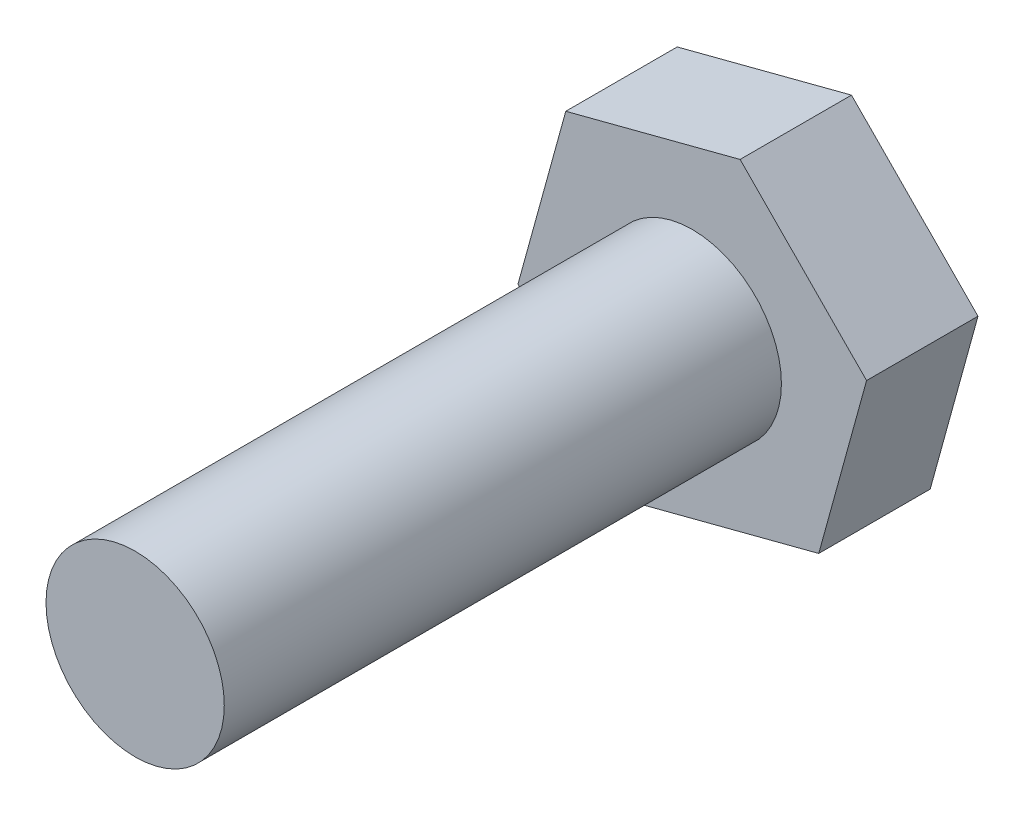
ISO-10303-21;
HEADER;
FILE_DESCRIPTION(('STEP AP214'),'2;1');
FILE_NAME('part.step','',(''),(''),'','','');
FILE_SCHEMA(('AUTOMOTIVE_DESIGN { 1 0 10303 214 1 1 1 1 }'));
ENDSEC;
DATA;
#1=APPLICATION_CONTEXT('core data for automotive mechanical design processes');
#2=APPLICATION_PROTOCOL_DEFINITION('international standard','automotive_design',2000,#1);
#3=PRODUCT_CONTEXT('',#1,'mechanical');
#4=PRODUCT('Part','Part','',(#3));
#5=PRODUCT_RELATED_PRODUCT_CATEGORY('part','',(#4));
#6=PRODUCT_DEFINITION_FORMATION('','',#4);
#7=PRODUCT_DEFINITION_CONTEXT('part definition',#1,'design');
#8=PRODUCT_DEFINITION('design','',#6,#7);
#9=PRODUCT_DEFINITION_SHAPE('','',#8);
#10=(LENGTH_UNIT() NAMED_UNIT(*) SI_UNIT(.MILLI.,.METRE.));
#11=(NAMED_UNIT(*) PLANE_ANGLE_UNIT() SI_UNIT($,.RADIAN.));
#12=(NAMED_UNIT(*) SI_UNIT($,.STERADIAN.) SOLID_ANGLE_UNIT());
#13=UNCERTAINTY_MEASURE_WITH_UNIT(LENGTH_MEASURE(1.E-05),#10,'distance_accuracy_value','');
#14=(GEOMETRIC_REPRESENTATION_CONTEXT(3) GLOBAL_UNCERTAINTY_ASSIGNED_CONTEXT((#13)) GLOBAL_UNIT_ASSIGNED_CONTEXT((#10,
#11,#12)) REPRESENTATION_CONTEXT('',''));
#15=CARTESIAN_POINT('',(0.,0.,0.));
#16=DIRECTION('',(0.,0.,1.));
#17=DIRECTION('',(1.,0.,0.));
#18=AXIS2_PLACEMENT_3D('',#15,#16,#17);
#19=CARTESIAN_POINT('',(-2.14543503921936,-7.79297387560251,5.));
#20=DIRECTION('',(-0.252197199176515,0.967675861395499,0.));
#21=DIRECTION('',(-0.967675861395499,-0.252197199176515,0.));
#22=AXIS2_PLACEMENT_3D('',#19,#20,#21);
#23=PLANE('',#22);
#24=DIRECTION('',(0.967675861395499,0.252197199176515,0.));
#25=VECTOR('',#24,1.);
#26=CARTESIAN_POINT('',(-2.14543503921936,-7.79297387560251,0.));
#27=LINE('',#26,#25);
#28=CARTESIAN_POINT('',(-2.14543503921936,-7.79297387560251,0.));
#29=VERTEX_POINT('',#28);
#30=CARTESIAN_POINT('',(5.67619582769056,-5.75448818393448,0.));
#31=VERTEX_POINT('',#30);
#32=EDGE_CURVE('E117',#29,#31,#27,.T.);
#33=ORIENTED_EDGE('',*,*,#32,.T.);
#34=DIRECTION('',(0.,0.,-1.));
#35=VECTOR('',#34,1.);
#36=CARTESIAN_POINT('',(5.67619582769056,-5.75448818393448,5.));
#37=LINE('',#36,#35);
#38=CARTESIAN_POINT('',(5.67619582769056,-5.75448818393448,5.));
#39=VERTEX_POINT('',#38);
#40=EDGE_CURVE('E11',#39,#31,#37,.T.);
#41=ORIENTED_EDGE('',*,*,#40,.F.);
#42=DIRECTION('',(0.967675861395499,0.252197199176515,0.));
#43=VECTOR('',#42,1.);
#44=CARTESIAN_POINT('',(-2.14543503921936,-7.79297387560251,5.));
#45=LINE('',#44,#43);
#46=CARTESIAN_POINT('',(-2.14543503921936,-7.79297387560251,5.));
#47=VERTEX_POINT('',#46);
#48=EDGE_CURVE('E128',#47,#39,#45,.T.);
#49=ORIENTED_EDGE('',*,*,#48,.F.);
#50=DIRECTION('',(0.,0.,-1.));
#51=VECTOR('',#50,1.);
#52=CARTESIAN_POINT('',(-2.14543503921936,-7.79297387560251,5.));
#53=LINE('',#52,#51);
#54=EDGE_CURVE('E113',#47,#29,#53,.T.);
#55=ORIENTED_EDGE('',*,*,#54,.T.);
#56=EDGE_LOOP('',(#33,#41,#49,#55));
#57=FACE_BOUND('',#56,.T.);
#58=ADVANCED_FACE('F33',(#57),#23,.F.);
#59=CARTESIAN_POINT('',(5.67619582769056,-5.75448818393448,5.));
#60=DIRECTION('',(-0.964130478185749,0.265428749447604,0.));
#61=DIRECTION('',(-0.265428749447604,-0.964130478185749,0.));
#62=AXIS2_PLACEMENT_3D('',#59,#60,#61);
#63=PLANE('',#62);
#64=DIRECTION('',(0.265428749447604,0.964130478185749,0.));
#65=VECTOR('',#64,1.);
#66=CARTESIAN_POINT('',(5.67619582769056,-5.75448818393448,0.));
#67=LINE('',#66,#65);
#68=CARTESIAN_POINT('',(7.82163086690992,2.03848569166803,0.));
#69=VERTEX_POINT('',#68);
#70=EDGE_CURVE('E120',#31,#69,#67,.T.);
#71=ORIENTED_EDGE('',*,*,#70,.T.);
#72=DIRECTION('',(0.,0.,-1.));
#73=VECTOR('',#72,1.);
#74=CARTESIAN_POINT('',(7.82163086690992,2.03848569166803,5.));
#75=LINE('',#74,#73);
#76=CARTESIAN_POINT('',(7.82163086690992,2.03848569166803,5.));
#77=VERTEX_POINT('',#76);
#78=EDGE_CURVE('E41',#77,#69,#75,.T.);
#79=ORIENTED_EDGE('',*,*,#78,.F.);
#80=DIRECTION('',(0.265428749447604,0.964130478185749,0.));
#81=VECTOR('',#80,1.);
#82=CARTESIAN_POINT('',(5.67619582769056,-5.75448818393448,5.));
#83=LINE('',#82,#81);
#84=EDGE_CURVE('E86',#39,#77,#83,.T.);
#85=ORIENTED_EDGE('',*,*,#84,.F.);
#86=ORIENTED_EDGE('',*,*,#40,.T.);
#87=EDGE_LOOP('',(#71,#79,#85,#86));
#88=FACE_BOUND('',#87,.T.);
#89=ADVANCED_FACE('F153',(#88),#63,.F.);
#90=CARTESIAN_POINT('',(7.82163086690992,2.03848569166803,5.));
#91=DIRECTION('',(-0.711933279009234,-0.702247111947895,0.));
#92=DIRECTION('',(0.702247111947895,-0.711933279009234,0.));
#93=AXIS2_PLACEMENT_3D('',#90,#91,#92);
#94=PLANE('',#93);
#95=DIRECTION('',(-0.702247111947895,0.711933279009234,0.));
#96=VECTOR('',#95,1.);
#97=CARTESIAN_POINT('',(7.82163086690992,2.03848569166803,0.));
#98=LINE('',#97,#96);
#99=CARTESIAN_POINT('',(2.14543503921936,7.79297387560251,0.));
#100=VERTEX_POINT('',#99);
#101=EDGE_CURVE('E123',#69,#100,#98,.T.);
#102=ORIENTED_EDGE('',*,*,#101,.T.);
#103=DIRECTION('',(0.,0.,-1.));
#104=VECTOR('',#103,1.);
#105=CARTESIAN_POINT('',(2.14543503921936,7.79297387560251,5.));
#106=LINE('',#105,#104);
#107=CARTESIAN_POINT('',(2.14543503921936,7.79297387560251,5.));
#108=VERTEX_POINT('',#107);
#109=EDGE_CURVE('E108',#108,#100,#106,.T.);
#110=ORIENTED_EDGE('',*,*,#109,.F.);
#111=DIRECTION('',(-0.702247111947895,0.711933279009234,0.));
#112=VECTOR('',#111,1.);
#113=CARTESIAN_POINT('',(7.82163086690992,2.03848569166803,5.));
#114=LINE('',#113,#112);
#115=EDGE_CURVE('E99',#77,#108,#114,.T.);
#116=ORIENTED_EDGE('',*,*,#115,.F.);
#117=ORIENTED_EDGE('',*,*,#78,.T.);
#118=EDGE_LOOP('',(#102,#110,#116,#117));
#119=FACE_BOUND('',#118,.T.);
#120=ADVANCED_FACE('F134',(#119),#94,.F.);
#121=CARTESIAN_POINT('',(2.14543503921936,7.79297387560251,5.));
#122=DIRECTION('',(0.252197199176515,-0.967675861395499,0.));
#123=DIRECTION('',(0.967675861395499,0.252197199176515,0.));
#124=AXIS2_PLACEMENT_3D('',#121,#122,#123);
#125=PLANE('',#124);
#126=DIRECTION('',(-0.967675861395499,-0.252197199176515,0.));
#127=VECTOR('',#126,1.);
#128=CARTESIAN_POINT('',(2.14543503921936,7.79297387560251,0.));
#129=LINE('',#128,#127);
#130=CARTESIAN_POINT('',(-5.67619582769057,5.75448818393448,0.));
#131=VERTEX_POINT('',#130);
#132=EDGE_CURVE('E107',#100,#131,#129,.T.);
#133=ORIENTED_EDGE('',*,*,#132,.T.);
#134=DIRECTION('',(0.,0.,-1.));
#135=VECTOR('',#134,1.);
#136=CARTESIAN_POINT('',(-5.67619582769057,5.75448818393448,5.));
#137=LINE('',#136,#135);
#138=CARTESIAN_POINT('',(-5.67619582769057,5.75448818393448,5.));
#139=VERTEX_POINT('',#138);
#140=EDGE_CURVE('E104',#139,#131,#137,.T.);
#141=ORIENTED_EDGE('',*,*,#140,.F.);
#142=DIRECTION('',(-0.967675861395499,-0.252197199176515,0.));
#143=VECTOR('',#142,1.);
#144=CARTESIAN_POINT('',(2.14543503921936,7.79297387560251,5.));
#145=LINE('',#144,#143);
#146=EDGE_CURVE('E93',#108,#139,#145,.T.);
#147=ORIENTED_EDGE('',*,*,#146,.F.);
#148=ORIENTED_EDGE('',*,*,#109,.T.);
#149=EDGE_LOOP('',(#133,#141,#147,#148));
#150=FACE_BOUND('',#149,.T.);
#151=ADVANCED_FACE('F105',(#150),#125,.F.);
#152=CARTESIAN_POINT('',(-5.67619582769057,5.75448818393448,5.));
#153=DIRECTION('',(0.964130478185749,-0.265428749447604,0.));
#154=DIRECTION('',(0.265428749447604,0.964130478185749,0.));
#155=AXIS2_PLACEMENT_3D('',#152,#153,#154);
#156=PLANE('',#155);
#157=DIRECTION('',(-0.265428749447604,-0.964130478185749,0.));
#158=VECTOR('',#157,1.);
#159=CARTESIAN_POINT('',(-5.67619582769057,5.75448818393448,0.));
#160=LINE('',#159,#158);
#161=CARTESIAN_POINT('',(-7.82163086690992,-2.03848569166803,0.));
#162=VERTEX_POINT('',#161);
#163=EDGE_CURVE('E72',#131,#162,#160,.T.);
#164=ORIENTED_EDGE('',*,*,#163,.T.);
#165=DIRECTION('',(0.,0.,-1.));
#166=VECTOR('',#165,1.);
#167=CARTESIAN_POINT('',(-7.82163086690992,-2.03848569166803,5.));
#168=LINE('',#167,#166);
#169=CARTESIAN_POINT('',(-7.82163086690992,-2.03848569166803,5.));
#170=VERTEX_POINT('',#169);
#171=EDGE_CURVE('E109',#170,#162,#168,.T.);
#172=ORIENTED_EDGE('',*,*,#171,.F.);
#173=DIRECTION('',(-0.265428749447604,-0.964130478185749,0.));
#174=VECTOR('',#173,1.);
#175=CARTESIAN_POINT('',(-5.67619582769057,5.75448818393448,5.));
#176=LINE('',#175,#174);
#177=EDGE_CURVE('E97',#139,#170,#176,.T.);
#178=ORIENTED_EDGE('',*,*,#177,.F.);
#179=ORIENTED_EDGE('',*,*,#140,.T.);
#180=EDGE_LOOP('',(#164,#172,#178,#179));
#181=FACE_BOUND('',#180,.T.);
#182=ADVANCED_FACE('F111',(#181),#156,.F.);
#183=CARTESIAN_POINT('',(-7.82163086690992,-2.03848569166803,5.));
#184=DIRECTION('',(0.711933279009234,0.702247111947895,0.));
#185=DIRECTION('',(-0.702247111947895,0.711933279009234,0.));
#186=AXIS2_PLACEMENT_3D('',#183,#184,#185);
#187=PLANE('',#186);
#188=DIRECTION('',(0.702247111947895,-0.711933279009234,0.));
#189=VECTOR('',#188,1.);
#190=CARTESIAN_POINT('',(-7.82163086690992,-2.03848569166803,0.));
#191=LINE('',#190,#189);
#192=EDGE_CURVE('E78',#162,#29,#191,.T.);
#193=ORIENTED_EDGE('',*,*,#192,.T.);
#194=ORIENTED_EDGE('',*,*,#54,.F.);
#195=DIRECTION('',(0.702247111947895,-0.711933279009234,0.));
#196=VECTOR('',#195,1.);
#197=CARTESIAN_POINT('',(-7.82163086690992,-2.03848569166803,5.));
#198=LINE('',#197,#196);
#199=EDGE_CURVE('E49',#170,#47,#198,.T.);
#200=ORIENTED_EDGE('',*,*,#199,.F.);
#201=ORIENTED_EDGE('',*,*,#171,.T.);
#202=EDGE_LOOP('',(#193,#194,#200,#201));
#203=FACE_BOUND('',#202,.T.);
#204=ADVANCED_FACE('F141',(#203),#187,.F.);
#205=CARTESIAN_POINT('',(0.,0.,5.));
#206=DIRECTION('',(0.,0.,1.));
#207=DIRECTION('',(1.,0.,0.));
#208=AXIS2_PLACEMENT_3D('',#205,#206,#207);
#209=PLANE('',#208);
#210=CARTESIAN_POINT('',(0.,0.,5.));
#211=DIRECTION('',(0.,0.,1.));
#212=DIRECTION('',(1.,0.,0.));
#213=AXIS2_PLACEMENT_3D('',#210,#211,#212);
#214=CIRCLE('',#213,4.);
#215=CARTESIAN_POINT('',(4.,0.,5.));
#216=VERTEX_POINT('',#215);
#217=EDGE_CURVE('E214',#216,#216,#214,.T.);
#218=ORIENTED_EDGE('',*,*,#217,.F.);
#219=EDGE_LOOP('',(#218));
#220=FACE_BOUND('',#219,.T.);
#221=ORIENTED_EDGE('',*,*,#48,.T.);
#222=ORIENTED_EDGE('',*,*,#84,.T.);
#223=ORIENTED_EDGE('',*,*,#115,.T.);
#224=ORIENTED_EDGE('',*,*,#146,.T.);
#225=ORIENTED_EDGE('',*,*,#177,.T.);
#226=ORIENTED_EDGE('',*,*,#199,.T.);
#227=EDGE_LOOP('',(#221,#222,#223,#224,#225,#226));
#228=FACE_BOUND('',#227,.T.);
#229=ADVANCED_FACE('F95',(#220,#228),#209,.T.);
#230=CARTESIAN_POINT('',(0.,0.,0.));
#231=DIRECTION('',(0.,0.,1.));
#232=DIRECTION('',(1.,0.,0.));
#233=AXIS2_PLACEMENT_3D('',#230,#231,#232);
#234=PLANE('',#233);
#235=ORIENTED_EDGE('',*,*,#32,.F.);
#236=ORIENTED_EDGE('',*,*,#192,.F.);
#237=ORIENTED_EDGE('',*,*,#163,.F.);
#238=ORIENTED_EDGE('',*,*,#132,.F.);
#239=ORIENTED_EDGE('',*,*,#101,.F.);
#240=ORIENTED_EDGE('',*,*,#70,.F.);
#241=EDGE_LOOP('',(#235,#236,#237,#238,#239,#240));
#242=FACE_BOUND('',#241,.T.);
#243=ADVANCED_FACE('F137',(#242),#234,.F.);
#244=CARTESIAN_POINT('',(0.,0.,30.));
#245=DIRECTION('',(0.,0.,-1.));
#246=DIRECTION('',(-1.,0.,0.));
#247=AXIS2_PLACEMENT_3D('',#244,#245,#246);
#248=CYLINDRICAL_SURFACE('',#247,4.);
#249=CARTESIAN_POINT('',(0.,0.,30.));
#250=DIRECTION('',(0.,0.,1.));
#251=DIRECTION('',(1.,0.,0.));
#252=AXIS2_PLACEMENT_3D('',#249,#250,#251);
#253=CIRCLE('',#252,4.);
#254=CARTESIAN_POINT('',(4.,0.,30.));
#255=VERTEX_POINT('',#254);
#256=EDGE_CURVE('E121',#255,#255,#253,.T.);
#257=ORIENTED_EDGE('',*,*,#256,.F.);
#258=EDGE_LOOP('',(#257));
#259=FACE_BOUND('',#258,.T.);
#260=ORIENTED_EDGE('',*,*,#217,.T.);
#261=EDGE_LOOP('',(#260));
#262=FACE_BOUND('',#261,.T.);
#263=ADVANCED_FACE('F185',(#259,#262),#248,.T.);
#264=CARTESIAN_POINT('',(0.,0.,30.));
#265=DIRECTION('',(0.,0.,1.));
#266=DIRECTION('',(1.,0.,0.));
#267=AXIS2_PLACEMENT_3D('',#264,#265,#266);
#268=PLANE('',#267);
#269=ORIENTED_EDGE('',*,*,#256,.T.);
#270=EDGE_LOOP('',(#269));
#271=FACE_BOUND('',#270,.T.);
#272=ADVANCED_FACE('F198',(#271),#268,.T.);
#273=CLOSED_SHELL('',(#58,#89,#120,#151,#182,#204,#229,#243,#263,#272));
#274=MANIFOLD_SOLID_BREP('B2',#273);
#275=ADVANCED_BREP_SHAPE_REPRESENTATION('',(#18,#274),#14);
#276=SHAPE_DEFINITION_REPRESENTATION(#9,#275);
ENDSEC;
END-ISO-10303-21;
